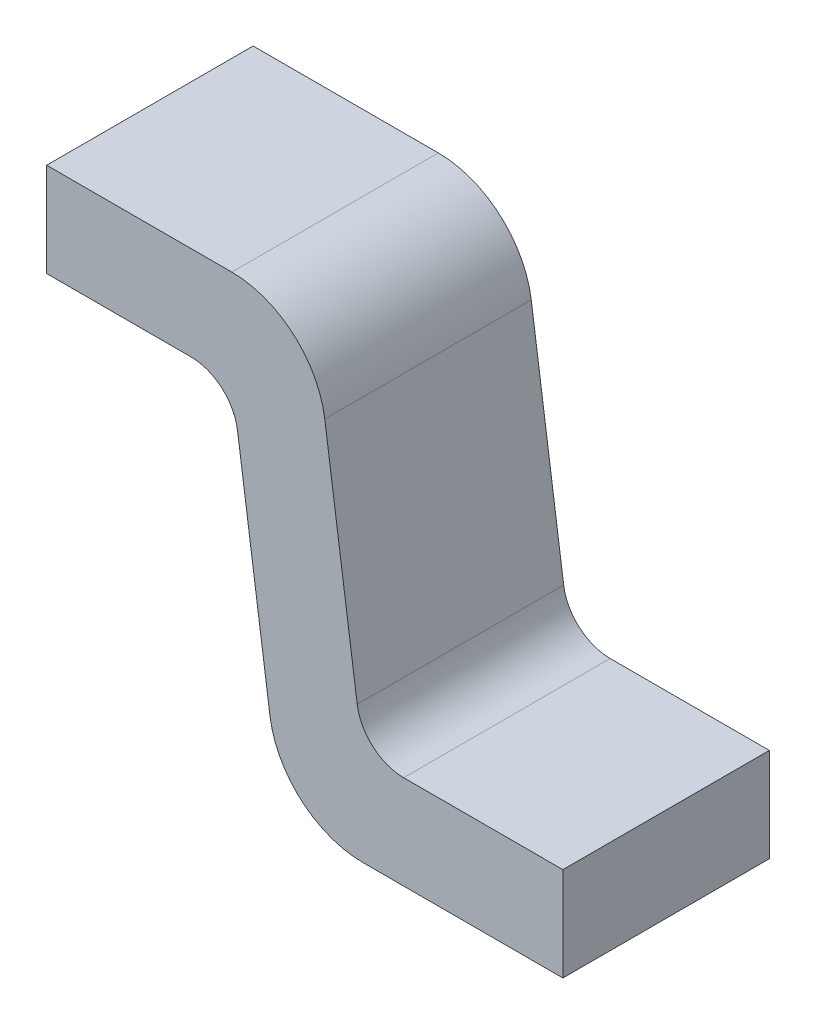
ISO-10303-21;
HEADER;
FILE_DESCRIPTION(('STEP AP214'),'2;1');
FILE_NAME('part.step','',(''),(''),'','','');
FILE_SCHEMA(('AUTOMOTIVE_DESIGN { 1 0 10303 214 1 1 1 1 }'));
ENDSEC;
DATA;
#1=APPLICATION_CONTEXT('core data for automotive mechanical design processes');
#2=APPLICATION_PROTOCOL_DEFINITION('international standard','automotive_design',2000,#1);
#3=PRODUCT_CONTEXT('',#1,'mechanical');
#4=PRODUCT('Part','Part','',(#3));
#5=PRODUCT_RELATED_PRODUCT_CATEGORY('part','',(#4));
#6=PRODUCT_DEFINITION_FORMATION('','',#4);
#7=PRODUCT_DEFINITION_CONTEXT('part definition',#1,'design');
#8=PRODUCT_DEFINITION('design','',#6,#7);
#9=PRODUCT_DEFINITION_SHAPE('','',#8);
#10=(LENGTH_UNIT() NAMED_UNIT(*) SI_UNIT(.MILLI.,.METRE.));
#11=(NAMED_UNIT(*) PLANE_ANGLE_UNIT() SI_UNIT($,.RADIAN.));
#12=(NAMED_UNIT(*) SI_UNIT($,.STERADIAN.) SOLID_ANGLE_UNIT());
#13=UNCERTAINTY_MEASURE_WITH_UNIT(LENGTH_MEASURE(1.E-05),#10,'distance_accuracy_value','');
#14=(GEOMETRIC_REPRESENTATION_CONTEXT(3) GLOBAL_UNCERTAINTY_ASSIGNED_CONTEXT((#13)) GLOBAL_UNIT_ASSIGNED_CONTEXT((#10,
#11,#12)) REPRESENTATION_CONTEXT('',''));
#15=CARTESIAN_POINT('',(0.,0.,0.));
#16=DIRECTION('',(0.,0.,1.));
#17=DIRECTION('',(1.,0.,0.));
#18=AXIS2_PLACEMENT_3D('',#15,#16,#17);
#19=CARTESIAN_POINT('',(1.1,0.,-0.22));
#20=DIRECTION('',(1.,0.,0.));
#21=DIRECTION('',(0.,0.,-1.));
#22=AXIS2_PLACEMENT_3D('',#19,#20,#21);
#23=PLANE('',#22);
#24=DIRECTION('',(0.,0.,1.));
#25=VECTOR('',#24,1.);
#26=CARTESIAN_POINT('',(1.1,0.2,-0.22));
#27=LINE('',#26,#25);
#28=CARTESIAN_POINT('',(1.1,0.2,-0.22));
#29=VERTEX_POINT('',#28);
#30=CARTESIAN_POINT('',(1.1,0.2,0.22));
#31=VERTEX_POINT('',#30);
#32=EDGE_CURVE('E35',#29,#31,#27,.T.);
#33=ORIENTED_EDGE('',*,*,#32,.T.);
#34=DIRECTION('',(0.,1.,0.));
#35=VECTOR('',#34,1.);
#36=CARTESIAN_POINT('',(1.1,0.,0.22));
#37=LINE('',#36,#35);
#38=CARTESIAN_POINT('',(1.1,0.,0.22));
#39=VERTEX_POINT('',#38);
#40=EDGE_CURVE('E120',#39,#31,#37,.T.);
#41=ORIENTED_EDGE('',*,*,#40,.F.);
#42=DIRECTION('',(0.,0.,1.));
#43=VECTOR('',#42,1.);
#44=CARTESIAN_POINT('',(1.1,0.,-0.22));
#45=LINE('',#44,#43);
#46=CARTESIAN_POINT('',(1.1,0.,-0.22));
#47=VERTEX_POINT('',#46);
#48=EDGE_CURVE('E11',#47,#39,#45,.T.);
#49=ORIENTED_EDGE('',*,*,#48,.F.);
#50=DIRECTION('',(0.,1.,0.));
#51=VECTOR('',#50,1.);
#52=CARTESIAN_POINT('',(1.1,0.,-0.22));
#53=LINE('',#52,#51);
#54=EDGE_CURVE('E121',#47,#29,#53,.T.);
#55=ORIENTED_EDGE('',*,*,#54,.T.);
#56=EDGE_LOOP('',(#33,#41,#49,#55));
#57=FACE_BOUND('',#56,.T.);
#58=ADVANCED_FACE('F32',(#57),#23,.T.);
#59=CARTESIAN_POINT('',(0.673857347563247,0.,-0.22));
#60=DIRECTION('',(0.,-1.,0.));
#61=DIRECTION('',(1.,0.,0.));
#62=AXIS2_PLACEMENT_3D('',#59,#60,#61);
#63=PLANE('',#62);
#64=ORIENTED_EDGE('',*,*,#48,.T.);
#65=DIRECTION('',(1.,0.,0.));
#66=VECTOR('',#65,1.);
#67=CARTESIAN_POINT('',(0.673857347563247,0.,0.22));
#68=LINE('',#67,#66);
#69=CARTESIAN_POINT('',(0.673857347563247,0.,0.22));
#70=VERTEX_POINT('',#69);
#71=EDGE_CURVE('E138',#70,#39,#68,.T.);
#72=ORIENTED_EDGE('',*,*,#71,.F.);
#73=DIRECTION('',(0.,0.,1.));
#74=VECTOR('',#73,1.);
#75=CARTESIAN_POINT('',(0.673857347563247,0.,-0.22));
#76=LINE('',#75,#74);
#77=CARTESIAN_POINT('',(0.673857347563247,0.,-0.22));
#78=VERTEX_POINT('',#77);
#79=EDGE_CURVE('E40',#78,#70,#76,.T.);
#80=ORIENTED_EDGE('',*,*,#79,.F.);
#81=DIRECTION('',(1.,0.,0.));
#82=VECTOR('',#81,1.);
#83=CARTESIAN_POINT('',(0.673857347563247,0.,-0.22));
#84=LINE('',#83,#82);
#85=EDGE_CURVE('E126',#78,#47,#84,.T.);
#86=ORIENTED_EDGE('',*,*,#85,.T.);
#87=EDGE_LOOP('',(#64,#72,#80,#86));
#88=FACE_BOUND('',#87,.T.);
#89=ADVANCED_FACE('F250',(#88),#63,.T.);
#90=CARTESIAN_POINT('',(0.673857347563247,0.2,-0.22));
#91=DIRECTION('',(0.,0.,1.));
#92=DIRECTION('',(1.,0.,0.));
#93=AXIS2_PLACEMENT_3D('',#90,#91,#92);
#94=CYLINDRICAL_SURFACE('',#93,0.2);
#95=ORIENTED_EDGE('',*,*,#79,.T.);
#96=CARTESIAN_POINT('',(0.673857347563247,0.2,0.22));
#97=DIRECTION('',(0.,0.,1.));
#98=DIRECTION('',(1.,0.,0.));
#99=AXIS2_PLACEMENT_3D('',#96,#97,#98);
#100=CIRCLE('',#99,0.2);
#101=CARTESIAN_POINT('',(0.475803733814932,0.172165379807988,0.22));
#102=VERTEX_POINT('',#101);
#103=EDGE_CURVE('E163',#102,#70,#100,.T.);
#104=ORIENTED_EDGE('',*,*,#103,.F.);
#105=DIRECTION('',(0.,0.,1.));
#106=VECTOR('',#105,1.);
#107=CARTESIAN_POINT('',(0.475803733814932,0.172165379807988,-0.22));
#108=LINE('',#107,#106);
#109=CARTESIAN_POINT('',(0.475803733814932,0.172165379807988,-0.22));
#110=VERTEX_POINT('',#109);
#111=EDGE_CURVE('E197',#110,#102,#108,.T.);
#112=ORIENTED_EDGE('',*,*,#111,.F.);
#113=CARTESIAN_POINT('',(0.673857347563247,0.2,-0.22));
#114=DIRECTION('',(0.,0.,1.));
#115=DIRECTION('',(1.,0.,0.));
#116=AXIS2_PLACEMENT_3D('',#113,#114,#115);
#117=CIRCLE('',#116,0.2);
#118=EDGE_CURVE('E193',#110,#78,#117,.T.);
#119=ORIENTED_EDGE('',*,*,#118,.T.);
#120=EDGE_LOOP('',(#95,#104,#112,#119));
#121=FACE_BOUND('',#120,.T.);
#122=ADVANCED_FACE('F248',(#121),#94,.T.);
#123=CARTESIAN_POINT('',(0.475803733814932,0.172165379807988,-0.22));
#124=DIRECTION('',(-0.990268068741571,-0.139173100960059,0.));
#125=DIRECTION('',(0.139173100960059,-0.990268068741571,0.));
#126=AXIS2_PLACEMENT_3D('',#123,#124,#125);
#127=PLANE('',#126);
#128=ORIENTED_EDGE('',*,*,#111,.T.);
#129=DIRECTION('',(0.139173100960059,-0.990268068741571,0.));
#130=VECTOR('',#129,1.);
#131=CARTESIAN_POINT('',(0.475803733814932,0.172165379807988,0.22));
#132=LINE('',#131,#130);
#133=CARTESIAN_POINT('',(0.406692507065746,0.663917310096006,0.22));
#134=VERTEX_POINT('',#133);
#135=EDGE_CURVE('E160',#134,#102,#132,.T.);
#136=ORIENTED_EDGE('',*,*,#135,.F.);
#137=DIRECTION('',(0.,0.,1.));
#138=VECTOR('',#137,1.);
#139=CARTESIAN_POINT('',(0.406692507065746,0.663917310096006,-0.22));
#140=LINE('',#139,#138);
#141=CARTESIAN_POINT('',(0.406692507065746,0.663917310096006,-0.22));
#142=VERTEX_POINT('',#141);
#143=EDGE_CURVE('E199',#142,#134,#140,.T.);
#144=ORIENTED_EDGE('',*,*,#143,.F.);
#145=DIRECTION('',(0.139173100960059,-0.990268068741571,0.));
#146=VECTOR('',#145,1.);
#147=CARTESIAN_POINT('',(0.475803733814932,0.172165379807988,-0.22));
#148=LINE('',#147,#146);
#149=EDGE_CURVE('E190',#142,#110,#148,.T.);
#150=ORIENTED_EDGE('',*,*,#149,.T.);
#151=EDGE_LOOP('',(#128,#136,#144,#150));
#152=FACE_BOUND('',#151,.T.);
#153=ADVANCED_FACE('F246',(#152),#127,.T.);
#154=CARTESIAN_POINT('',(0.307665700191588,0.65,-0.22));
#155=DIRECTION('',(0.,0.,1.));
#156=DIRECTION('',(1.,0.,0.));
#157=AXIS2_PLACEMENT_3D('',#154,#155,#156);
#158=CYLINDRICAL_SURFACE('',#157,0.1);
#159=ORIENTED_EDGE('',*,*,#143,.T.);
#160=CARTESIAN_POINT('',(0.307665700191588,0.65,0.22));
#161=DIRECTION('',(0.,0.,-1.));
#162=DIRECTION('',(-1.,0.,0.));
#163=AXIS2_PLACEMENT_3D('',#160,#161,#162);
#164=CIRCLE('',#163,0.1);
#165=CARTESIAN_POINT('',(0.307665700191588,0.75,0.22));
#166=VERTEX_POINT('',#165);
#167=EDGE_CURVE('E157',#166,#134,#164,.T.);
#168=ORIENTED_EDGE('',*,*,#167,.F.);
#169=DIRECTION('',(0.,0.,1.));
#170=VECTOR('',#169,1.);
#171=CARTESIAN_POINT('',(0.307665700191588,0.75,-0.22));
#172=LINE('',#171,#170);
#173=CARTESIAN_POINT('',(0.307665700191588,0.75,-0.22));
#174=VERTEX_POINT('',#173);
#175=EDGE_CURVE('E201',#174,#166,#172,.T.);
#176=ORIENTED_EDGE('',*,*,#175,.F.);
#177=CARTESIAN_POINT('',(0.307665700191588,0.65,-0.22));
#178=DIRECTION('',(0.,0.,-1.));
#179=DIRECTION('',(-1.,0.,0.));
#180=AXIS2_PLACEMENT_3D('',#177,#178,#179);
#181=CIRCLE('',#180,0.1);
#182=EDGE_CURVE('E187',#174,#142,#181,.T.);
#183=ORIENTED_EDGE('',*,*,#182,.T.);
#184=EDGE_LOOP('',(#159,#168,#176,#183));
#185=FACE_BOUND('',#184,.T.);
#186=ADVANCED_FACE('F241',(#185),#158,.F.);
#187=CARTESIAN_POINT('',(0.307665700191588,0.75,-0.22));
#188=DIRECTION('',(0.,-1.,0.));
#189=DIRECTION('',(0.,0.,-1.));
#190=AXIS2_PLACEMENT_3D('',#187,#188,#189);
#191=PLANE('',#190);
#192=ORIENTED_EDGE('',*,*,#175,.T.);
#193=DIRECTION('',(1.,0.,0.));
#194=VECTOR('',#193,1.);
#195=CARTESIAN_POINT('',(0.307665700191588,0.75,0.22));
#196=LINE('',#195,#194);
#197=CARTESIAN_POINT('',(0.,0.75,0.22));
#198=VERTEX_POINT('',#197);
#199=EDGE_CURVE('E154',#198,#166,#196,.T.);
#200=ORIENTED_EDGE('',*,*,#199,.F.);
#201=DIRECTION('',(0.,0.,1.));
#202=VECTOR('',#201,1.);
#203=CARTESIAN_POINT('',(0.,0.75,-0.22));
#204=LINE('',#203,#202);
#205=CARTESIAN_POINT('',(0.,0.75,-0.22));
#206=VERTEX_POINT('',#205);
#207=EDGE_CURVE('E203',#206,#198,#204,.T.);
#208=ORIENTED_EDGE('',*,*,#207,.F.);
#209=DIRECTION('',(1.,0.,0.));
#210=VECTOR('',#209,1.);
#211=CARTESIAN_POINT('',(0.307665700191588,0.75,-0.22));
#212=LINE('',#211,#210);
#213=EDGE_CURVE('E184',#206,#174,#212,.T.);
#214=ORIENTED_EDGE('',*,*,#213,.T.);
#215=EDGE_LOOP('',(#192,#200,#208,#214));
#216=FACE_BOUND('',#215,.T.);
#217=ADVANCED_FACE('F236',(#216),#191,.T.);
#218=CARTESIAN_POINT('',(0.,0.95,-0.22));
#219=DIRECTION('',(-1.,0.,0.));
#220=DIRECTION('',(0.,-1.,0.));
#221=AXIS2_PLACEMENT_3D('',#218,#219,#220);
#222=PLANE('',#221);
#223=ORIENTED_EDGE('',*,*,#207,.T.);
#224=DIRECTION('',(0.,-1.,0.));
#225=VECTOR('',#224,1.);
#226=CARTESIAN_POINT('',(0.,0.95,0.22));
#227=LINE('',#226,#225);
#228=CARTESIAN_POINT('',(0.,0.95,0.22));
#229=VERTEX_POINT('',#228);
#230=EDGE_CURVE('E151',#229,#198,#227,.T.);
#231=ORIENTED_EDGE('',*,*,#230,.F.);
#232=DIRECTION('',(0.,0.,1.));
#233=VECTOR('',#232,1.);
#234=CARTESIAN_POINT('',(0.,0.95,-0.22));
#235=LINE('',#234,#233);
#236=CARTESIAN_POINT('',(0.,0.95,-0.22));
#237=VERTEX_POINT('',#236);
#238=EDGE_CURVE('E205',#237,#229,#235,.T.);
#239=ORIENTED_EDGE('',*,*,#238,.F.);
#240=DIRECTION('',(0.,-1.,0.));
#241=VECTOR('',#240,1.);
#242=CARTESIAN_POINT('',(0.,0.95,-0.22));
#243=LINE('',#242,#241);
#244=EDGE_CURVE('E181',#237,#206,#243,.T.);
#245=ORIENTED_EDGE('',*,*,#244,.T.);
#246=EDGE_LOOP('',(#223,#231,#239,#245));
#247=FACE_BOUND('',#246,.T.);
#248=ADVANCED_FACE('F234',(#247),#222,.T.);
#249=CARTESIAN_POINT('',(0.,0.95,-0.22));
#250=DIRECTION('',(0.,1.,0.));
#251=DIRECTION('',(-1.,0.,0.));
#252=AXIS2_PLACEMENT_3D('',#249,#250,#251);
#253=PLANE('',#252);
#254=ORIENTED_EDGE('',*,*,#238,.T.);
#255=DIRECTION('',(-1.,0.,0.));
#256=VECTOR('',#255,1.);
#257=CARTESIAN_POINT('',(0.,0.95,0.22));
#258=LINE('',#257,#256);
#259=CARTESIAN_POINT('',(0.394594373973212,0.95,0.22));
#260=VERTEX_POINT('',#259);
#261=EDGE_CURVE('E148',#260,#229,#258,.T.);
#262=ORIENTED_EDGE('',*,*,#261,.F.);
#263=DIRECTION('',(0.,0.,1.));
#264=VECTOR('',#263,1.);
#265=CARTESIAN_POINT('',(0.394594373973212,0.95,-0.22));
#266=LINE('',#265,#264);
#267=CARTESIAN_POINT('',(0.394594373973212,0.95,-0.22));
#268=VERTEX_POINT('',#267);
#269=EDGE_CURVE('E207',#268,#260,#266,.T.);
#270=ORIENTED_EDGE('',*,*,#269,.F.);
#271=DIRECTION('',(-1.,0.,0.));
#272=VECTOR('',#271,1.);
#273=CARTESIAN_POINT('',(0.,0.95,-0.22));
#274=LINE('',#273,#272);
#275=EDGE_CURVE('E178',#268,#237,#274,.T.);
#276=ORIENTED_EDGE('',*,*,#275,.T.);
#277=EDGE_LOOP('',(#254,#262,#270,#276));
#278=FACE_BOUND('',#277,.T.);
#279=ADVANCED_FACE('F229',(#278),#253,.T.);
#280=CARTESIAN_POINT('',(0.394594373973212,0.75,-0.22));
#281=DIRECTION('',(0.,0.,1.));
#282=DIRECTION('',(1.,0.,0.));
#283=AXIS2_PLACEMENT_3D('',#280,#281,#282);
#284=CYLINDRICAL_SURFACE('',#283,0.2);
#285=ORIENTED_EDGE('',*,*,#269,.T.);
#286=CARTESIAN_POINT('',(0.394594373973212,0.75,0.22));
#287=DIRECTION('',(0.,0.,1.));
#288=DIRECTION('',(-1.,0.,0.));
#289=AXIS2_PLACEMENT_3D('',#286,#287,#288);
#290=CIRCLE('',#289,0.2);
#291=CARTESIAN_POINT('',(0.592647987721526,0.777834620192012,0.22));
#292=VERTEX_POINT('',#291);
#293=EDGE_CURVE('E145',#292,#260,#290,.T.);
#294=ORIENTED_EDGE('',*,*,#293,.F.);
#295=DIRECTION('',(0.,0.,1.));
#296=VECTOR('',#295,1.);
#297=CARTESIAN_POINT('',(0.592647987721526,0.777834620192012,-0.22));
#298=LINE('',#297,#296);
#299=CARTESIAN_POINT('',(0.592647987721526,0.777834620192012,-0.22));
#300=VERTEX_POINT('',#299);
#301=EDGE_CURVE('E209',#300,#292,#298,.T.);
#302=ORIENTED_EDGE('',*,*,#301,.F.);
#303=CARTESIAN_POINT('',(0.394594373973212,0.75,-0.22));
#304=DIRECTION('',(0.,0.,1.));
#305=DIRECTION('',(-1.,0.,0.));
#306=AXIS2_PLACEMENT_3D('',#303,#304,#305);
#307=CIRCLE('',#306,0.2);
#308=EDGE_CURVE('E175',#300,#268,#307,.T.);
#309=ORIENTED_EDGE('',*,*,#308,.T.);
#310=EDGE_LOOP('',(#285,#294,#302,#309));
#311=FACE_BOUND('',#310,.T.);
#312=ADVANCED_FACE('F222',(#311),#284,.T.);
#313=CARTESIAN_POINT('',(0.592647987721526,0.777834620192012,-0.22));
#314=DIRECTION('',(0.990268068741571,0.139173100960058,0.));
#315=DIRECTION('',(-0.139173100960058,0.990268068741571,0.));
#316=AXIS2_PLACEMENT_3D('',#313,#314,#315);
#317=PLANE('',#316);
#318=ORIENTED_EDGE('',*,*,#301,.T.);
#319=DIRECTION('',(-0.139173100960058,0.990268068741571,0.));
#320=VECTOR('',#319,1.);
#321=CARTESIAN_POINT('',(0.592647987721526,0.777834620192012,0.22));
#322=LINE('',#321,#320);
#323=CARTESIAN_POINT('',(0.661759214470713,0.286082689903994,0.22));
#324=VERTEX_POINT('',#323);
#325=EDGE_CURVE('E142',#324,#292,#322,.T.);
#326=ORIENTED_EDGE('',*,*,#325,.F.);
#327=DIRECTION('',(0.,0.,1.));
#328=VECTOR('',#327,1.);
#329=CARTESIAN_POINT('',(0.661759214470713,0.286082689903994,-0.22));
#330=LINE('',#329,#328);
#331=CARTESIAN_POINT('',(0.661759214470713,0.286082689903994,-0.22));
#332=VERTEX_POINT('',#331);
#333=EDGE_CURVE('E211',#332,#324,#330,.T.);
#334=ORIENTED_EDGE('',*,*,#333,.F.);
#335=DIRECTION('',(-0.139173100960058,0.990268068741571,0.));
#336=VECTOR('',#335,1.);
#337=CARTESIAN_POINT('',(0.592647987721526,0.777834620192012,-0.22));
#338=LINE('',#337,#336);
#339=EDGE_CURVE('E172',#332,#300,#338,.T.);
#340=ORIENTED_EDGE('',*,*,#339,.T.);
#341=EDGE_LOOP('',(#318,#326,#334,#340));
#342=FACE_BOUND('',#341,.T.);
#343=ADVANCED_FACE('F219',(#342),#317,.T.);
#344=CARTESIAN_POINT('',(0.76078602134487,0.3,-0.22));
#345=DIRECTION('',(0.,0.,1.));
#346=DIRECTION('',(1.,0.,0.));
#347=AXIS2_PLACEMENT_3D('',#344,#345,#346);
#348=CYLINDRICAL_SURFACE('',#347,0.1);
#349=ORIENTED_EDGE('',*,*,#333,.T.);
#350=CARTESIAN_POINT('',(0.76078602134487,0.3,0.22));
#351=DIRECTION('',(0.,0.,-1.));
#352=DIRECTION('',(-1.,0.,0.));
#353=AXIS2_PLACEMENT_3D('',#350,#351,#352);
#354=CIRCLE('',#353,0.1);
#355=CARTESIAN_POINT('',(0.76078602134487,0.2,0.22));
#356=VERTEX_POINT('',#355);
#357=EDGE_CURVE('E133',#356,#324,#354,.T.);
#358=ORIENTED_EDGE('',*,*,#357,.F.);
#359=DIRECTION('',(0.,0.,1.));
#360=VECTOR('',#359,1.);
#361=CARTESIAN_POINT('',(0.76078602134487,0.2,-0.22));
#362=LINE('',#361,#360);
#363=CARTESIAN_POINT('',(0.76078602134487,0.2,-0.22));
#364=VERTEX_POINT('',#363);
#365=EDGE_CURVE('E125',#364,#356,#362,.T.);
#366=ORIENTED_EDGE('',*,*,#365,.F.);
#367=CARTESIAN_POINT('',(0.76078602134487,0.3,-0.22));
#368=DIRECTION('',(0.,0.,-1.));
#369=DIRECTION('',(-1.,0.,0.));
#370=AXIS2_PLACEMENT_3D('',#367,#368,#369);
#371=CIRCLE('',#370,0.1);
#372=EDGE_CURVE('E169',#364,#332,#371,.T.);
#373=ORIENTED_EDGE('',*,*,#372,.T.);
#374=EDGE_LOOP('',(#349,#358,#366,#373));
#375=FACE_BOUND('',#374,.T.);
#376=ADVANCED_FACE('F213',(#375),#348,.F.);
#377=CARTESIAN_POINT('',(1.1,0.2,-0.22));
#378=DIRECTION('',(0.,1.,0.));
#379=DIRECTION('',(-1.,0.,0.));
#380=AXIS2_PLACEMENT_3D('',#377,#378,#379);
#381=PLANE('',#380);
#382=ORIENTED_EDGE('',*,*,#365,.T.);
#383=DIRECTION('',(-1.,0.,0.));
#384=VECTOR('',#383,1.);
#385=CARTESIAN_POINT('',(1.1,0.2,0.22));
#386=LINE('',#385,#384);
#387=EDGE_CURVE('E128',#31,#356,#386,.T.);
#388=ORIENTED_EDGE('',*,*,#387,.F.);
#389=ORIENTED_EDGE('',*,*,#32,.F.);
#390=DIRECTION('',(-1.,0.,0.));
#391=VECTOR('',#390,1.);
#392=CARTESIAN_POINT('',(1.1,0.2,-0.22));
#393=LINE('',#392,#391);
#394=EDGE_CURVE('E167',#29,#364,#393,.T.);
#395=ORIENTED_EDGE('',*,*,#394,.T.);
#396=EDGE_LOOP('',(#382,#388,#389,#395));
#397=FACE_BOUND('',#396,.T.);
#398=ADVANCED_FACE('F129',(#397),#381,.T.);
#399=CARTESIAN_POINT('',(0.76078602134487,0.3,-0.22));
#400=DIRECTION('',(0.,0.,-1.));
#401=DIRECTION('',(-1.,0.,0.));
#402=AXIS2_PLACEMENT_3D('',#399,#400,#401);
#403=PLANE('',#402);
#404=ORIENTED_EDGE('',*,*,#54,.F.);
#405=ORIENTED_EDGE('',*,*,#85,.F.);
#406=ORIENTED_EDGE('',*,*,#118,.F.);
#407=ORIENTED_EDGE('',*,*,#149,.F.);
#408=ORIENTED_EDGE('',*,*,#182,.F.);
#409=ORIENTED_EDGE('',*,*,#213,.F.);
#410=ORIENTED_EDGE('',*,*,#244,.F.);
#411=ORIENTED_EDGE('',*,*,#275,.F.);
#412=ORIENTED_EDGE('',*,*,#308,.F.);
#413=ORIENTED_EDGE('',*,*,#339,.F.);
#414=ORIENTED_EDGE('',*,*,#372,.F.);
#415=ORIENTED_EDGE('',*,*,#394,.F.);
#416=EDGE_LOOP('',(#404,#405,#406,#407,#408,#409,#410,#411,#412,#413,#414,#415));
#417=FACE_BOUND('',#416,.T.);
#418=ADVANCED_FACE('F225',(#417),#403,.T.);
#419=CARTESIAN_POINT('',(0.76078602134487,0.3,0.22));
#420=DIRECTION('',(0.,0.,-1.));
#421=DIRECTION('',(-1.,0.,0.));
#422=AXIS2_PLACEMENT_3D('',#419,#420,#421);
#423=PLANE('',#422);
#424=ORIENTED_EDGE('',*,*,#40,.T.);
#425=ORIENTED_EDGE('',*,*,#387,.T.);
#426=ORIENTED_EDGE('',*,*,#357,.T.);
#427=ORIENTED_EDGE('',*,*,#325,.T.);
#428=ORIENTED_EDGE('',*,*,#293,.T.);
#429=ORIENTED_EDGE('',*,*,#261,.T.);
#430=ORIENTED_EDGE('',*,*,#230,.T.);
#431=ORIENTED_EDGE('',*,*,#199,.T.);
#432=ORIENTED_EDGE('',*,*,#167,.T.);
#433=ORIENTED_EDGE('',*,*,#135,.T.);
#434=ORIENTED_EDGE('',*,*,#103,.T.);
#435=ORIENTED_EDGE('',*,*,#71,.T.);
#436=EDGE_LOOP('',(#424,#425,#426,#427,#428,#429,#430,#431,#432,#433,#434,#435));
#437=FACE_BOUND('',#436,.T.);
#438=ADVANCED_FACE('F136',(#437),#423,.F.);
#439=CLOSED_SHELL('',(#58,#89,#122,#153,#186,#217,#248,#279,#312,#343,#376,#398,#418,#438));
#440=MANIFOLD_SOLID_BREP('B2',#439);
#441=ADVANCED_BREP_SHAPE_REPRESENTATION('',(#18,#440),#14);
#442=SHAPE_DEFINITION_REPRESENTATION(#9,#441);
ENDSEC;
END-ISO-10303-21;
